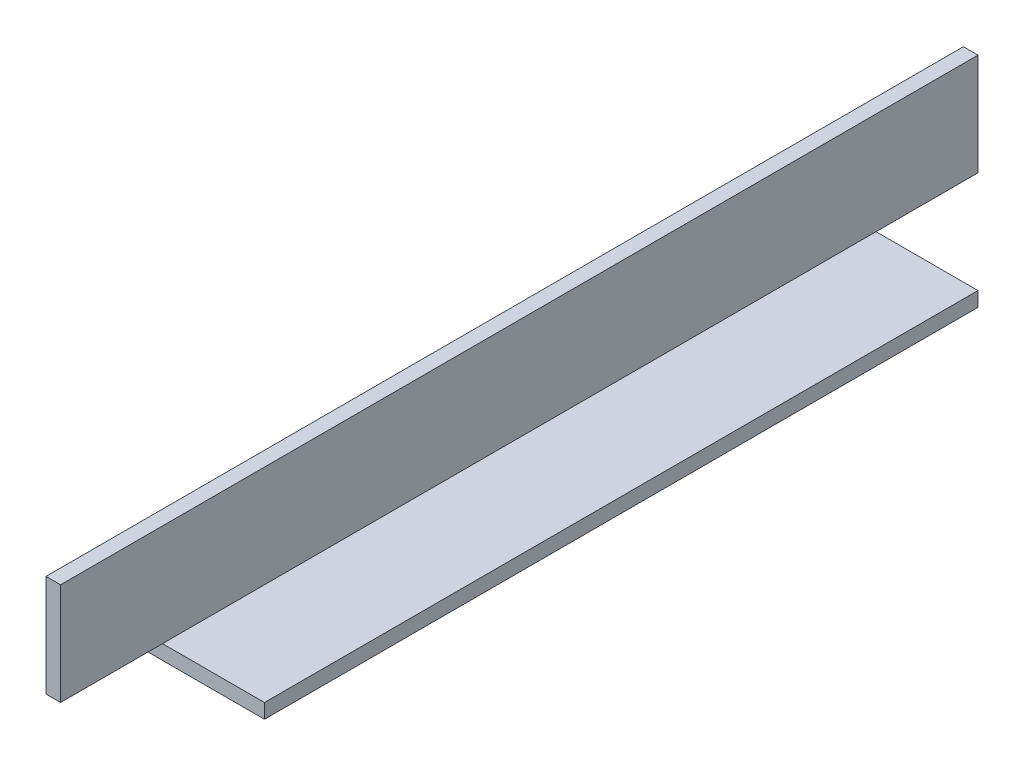
ISO-10303-21;
HEADER;
FILE_DESCRIPTION(('STEP AP214'),'2;1');
FILE_NAME('part.step','',(''),(''),'','','');
FILE_SCHEMA(('AUTOMOTIVE_DESIGN { 1 0 10303 214 1 1 1 1 }'));
ENDSEC;
DATA;
#1=APPLICATION_CONTEXT('core data for automotive mechanical design processes');
#2=APPLICATION_PROTOCOL_DEFINITION('international standard','automotive_design',2000,#1);
#3=PRODUCT_CONTEXT('',#1,'mechanical');
#4=PRODUCT('Part','Part','',(#3));
#5=PRODUCT_RELATED_PRODUCT_CATEGORY('part','',(#4));
#6=PRODUCT_DEFINITION_FORMATION('','',#4);
#7=PRODUCT_DEFINITION_CONTEXT('part definition',#1,'design');
#8=PRODUCT_DEFINITION('design','',#6,#7);
#9=PRODUCT_DEFINITION_SHAPE('','',#8);
#10=(LENGTH_UNIT() NAMED_UNIT(*) SI_UNIT(.MILLI.,.METRE.));
#11=(NAMED_UNIT(*) PLANE_ANGLE_UNIT() SI_UNIT($,.RADIAN.));
#12=(NAMED_UNIT(*) SI_UNIT($,.STERADIAN.) SOLID_ANGLE_UNIT());
#13=UNCERTAINTY_MEASURE_WITH_UNIT(LENGTH_MEASURE(1.E-05),#10,'distance_accuracy_value','');
#14=(GEOMETRIC_REPRESENTATION_CONTEXT(3) GLOBAL_UNCERTAINTY_ASSIGNED_CONTEXT((#13)) GLOBAL_UNIT_ASSIGNED_CONTEXT((#10,
#11,#12)) REPRESENTATION_CONTEXT('',''));
#15=CARTESIAN_POINT('',(0.,0.,0.));
#16=DIRECTION('',(0.,0.,1.));
#17=DIRECTION('',(1.,0.,0.));
#18=AXIS2_PLACEMENT_3D('',#15,#16,#17);
#19=CARTESIAN_POINT('',(0.,0.,1219.2));
#20=DIRECTION('',(0.,0.,1.));
#21=DIRECTION('',(1.,0.,0.));
#22=AXIS2_PLACEMENT_3D('',#19,#20,#21);
#23=PLANE('',#22);
#24=DIRECTION('',(1.,0.,0.));
#25=VECTOR('',#24,1.);
#26=CARTESIAN_POINT('',(25.4,3.175,1219.2));
#27=LINE('',#26,#25);
#28=CARTESIAN_POINT('',(0.,3.175,1219.2));
#29=VERTEX_POINT('',#28);
#30=CARTESIAN_POINT('',(3.175,3.175,1219.2));
#31=VERTEX_POINT('',#30);
#32=EDGE_CURVE('E163',#29,#31,#27,.T.);
#33=ORIENTED_EDGE('',*,*,#32,.T.);
#34=DIRECTION('',(0.,1.,0.));
#35=VECTOR('',#34,1.);
#36=CARTESIAN_POINT('',(3.175,3.175,1219.2));
#37=LINE('',#36,#35);
#38=CARTESIAN_POINT('',(3.175,25.4,1219.2));
#39=VERTEX_POINT('',#38);
#40=EDGE_CURVE('E55',#31,#39,#37,.T.);
#41=ORIENTED_EDGE('',*,*,#40,.T.);
#42=DIRECTION('',(-1.,0.,0.));
#43=VECTOR('',#42,1.);
#44=CARTESIAN_POINT('',(3.175,25.4,1219.2));
#45=LINE('',#44,#43);
#46=CARTESIAN_POINT('',(0.,25.4,1219.2));
#47=VERTEX_POINT('',#46);
#48=EDGE_CURVE('E145',#39,#47,#45,.T.);
#49=ORIENTED_EDGE('',*,*,#48,.T.);
#50=DIRECTION('',(0.,-1.,0.));
#51=VECTOR('',#50,1.);
#52=CARTESIAN_POINT('',(0.,25.4,1219.2));
#53=LINE('',#52,#51);
#54=EDGE_CURVE('E142',#47,#29,#53,.T.);
#55=ORIENTED_EDGE('',*,*,#54,.T.);
#56=EDGE_LOOP('',(#33,#41,#49,#55));
#57=FACE_BOUND('',#56,.T.);
#58=ADVANCED_FACE('F41',(#57),#23,.T.);
#59=CARTESIAN_POINT('',(60.,25.4,1019.2));
#60=DIRECTION('',(0.,0.,1.));
#61=DIRECTION('',(1.,0.,0.));
#62=AXIS2_PLACEMENT_3D('',#59,#60,#61);
#63=PLANE('',#62);
#64=DIRECTION('',(0.,1.,0.));
#65=VECTOR('',#64,1.);
#66=CARTESIAN_POINT('',(3.175,3.175,1019.2));
#67=LINE('',#66,#65);
#68=CARTESIAN_POINT('',(3.175,3.175,1019.2));
#69=VERTEX_POINT('',#68);
#70=CARTESIAN_POINT('',(3.17500000000002,25.4,1019.2));
#71=VERTEX_POINT('',#70);
#72=EDGE_CURVE('E113',#69,#71,#67,.T.);
#73=ORIENTED_EDGE('',*,*,#72,.F.);
#74=DIRECTION('',(1.,0.,0.));
#75=VECTOR('',#74,1.);
#76=CARTESIAN_POINT('',(60.,3.17500000000001,1019.2));
#77=LINE('',#76,#75);
#78=CARTESIAN_POINT('',(0.,3.175,1019.2));
#79=VERTEX_POINT('',#78);
#80=EDGE_CURVE('E49',#79,#69,#77,.T.);
#81=ORIENTED_EDGE('',*,*,#80,.F.);
#82=DIRECTION('',(0.,1.,0.));
#83=VECTOR('',#82,1.);
#84=CARTESIAN_POINT('',(0.,25.4,1019.2));
#85=LINE('',#84,#83);
#86=CARTESIAN_POINT('',(0.,25.4,1019.2));
#87=VERTEX_POINT('',#86);
#88=EDGE_CURVE('E149',#79,#87,#85,.T.);
#89=ORIENTED_EDGE('',*,*,#88,.T.);
#90=DIRECTION('',(-1.,0.,0.));
#91=VECTOR('',#90,1.);
#92=CARTESIAN_POINT('',(60.,25.4,1019.2));
#93=LINE('',#92,#91);
#94=EDGE_CURVE('E118',#71,#87,#93,.T.);
#95=ORIENTED_EDGE('',*,*,#94,.F.);
#96=EDGE_LOOP('',(#73,#81,#89,#95));
#97=FACE_BOUND('',#96,.T.);
#98=ADVANCED_FACE('F115',(#97),#63,.F.);
#99=CARTESIAN_POINT('',(3.175,3.175,1219.2));
#100=DIRECTION('',(-1.,0.,0.));
#101=DIRECTION('',(0.,-1.,0.));
#102=AXIS2_PLACEMENT_3D('',#99,#100,#101);
#103=PLANE('',#102);
#104=DIRECTION('',(0.,0.,-1.));
#105=VECTOR('',#104,1.);
#106=CARTESIAN_POINT('',(3.175,25.4,1219.2));
#107=LINE('',#106,#105);
#108=EDGE_CURVE('E129',#39,#71,#107,.T.);
#109=ORIENTED_EDGE('',*,*,#108,.F.);
#110=ORIENTED_EDGE('',*,*,#40,.F.);
#111=DIRECTION('',(0.,0.,-1.));
#112=VECTOR('',#111,1.);
#113=CARTESIAN_POINT('',(3.175,3.175,1219.2));
#114=LINE('',#113,#112);
#115=CARTESIAN_POINT('',(3.175,3.175,1196.97));
#116=VERTEX_POINT('',#115);
#117=EDGE_CURVE('E11',#31,#116,#114,.T.);
#118=ORIENTED_EDGE('',*,*,#117,.T.);
#119=DIRECTION('',(0.,0.,-1.));
#120=VECTOR('',#119,1.);
#121=CARTESIAN_POINT('',(3.175,3.175,1239.2));
#122=LINE('',#121,#120);
#123=CARTESIAN_POINT('',(3.175,3.175,1041.43));
#124=VERTEX_POINT('',#123);
#125=EDGE_CURVE('E125',#116,#124,#122,.T.);
#126=ORIENTED_EDGE('',*,*,#125,.T.);
#127=EDGE_CURVE('E123',#124,#69,#122,.T.);
#128=ORIENTED_EDGE('',*,*,#127,.T.);
#129=ORIENTED_EDGE('',*,*,#72,.T.);
#130=EDGE_LOOP('',(#109,#110,#118,#126,#128,#129));
#131=FACE_BOUND('',#130,.T.);
#132=ADVANCED_FACE('F43',(#131),#103,.F.);
#133=CARTESIAN_POINT('',(3.175,25.4,1219.2));
#134=DIRECTION('',(0.,-1.,0.));
#135=DIRECTION('',(1.,0.,0.));
#136=AXIS2_PLACEMENT_3D('',#133,#134,#135);
#137=PLANE('',#136);
#138=ORIENTED_EDGE('',*,*,#108,.T.);
#139=ORIENTED_EDGE('',*,*,#94,.T.);
#140=DIRECTION('',(0.,0.,-1.));
#141=VECTOR('',#140,1.);
#142=CARTESIAN_POINT('',(0.,25.4,1219.2));
#143=LINE('',#142,#141);
#144=EDGE_CURVE('E130',#47,#87,#143,.T.);
#145=ORIENTED_EDGE('',*,*,#144,.F.);
#146=ORIENTED_EDGE('',*,*,#48,.F.);
#147=EDGE_LOOP('',(#138,#139,#145,#146));
#148=FACE_BOUND('',#147,.T.);
#149=ADVANCED_FACE('F208',(#148),#137,.F.);
#150=CARTESIAN_POINT('',(0.,25.4,1219.2));
#151=DIRECTION('',(1.,0.,0.));
#152=DIRECTION('',(0.,1.,0.));
#153=AXIS2_PLACEMENT_3D('',#150,#151,#152);
#154=PLANE('',#153);
#155=DIRECTION('',(0.,0.,-1.));
#156=VECTOR('',#155,1.);
#157=CARTESIAN_POINT('',(0.,0.,1219.2));
#158=LINE('',#157,#156);
#159=CARTESIAN_POINT('',(0.,0.,1196.97));
#160=VERTEX_POINT('',#159);
#161=CARTESIAN_POINT('',(0.,0.,1041.43));
#162=VERTEX_POINT('',#161);
#163=EDGE_CURVE('E135',#160,#162,#158,.T.);
#164=ORIENTED_EDGE('',*,*,#163,.F.);
#165=DIRECTION('',(0.,-1.,0.));
#166=VECTOR('',#165,1.);
#167=CARTESIAN_POINT('',(0.,36.9290056882142,1196.97));
#168=LINE('',#167,#166);
#169=CARTESIAN_POINT('',(0.,3.175,1196.97));
#170=VERTEX_POINT('',#169);
#171=EDGE_CURVE('E168',#170,#160,#168,.T.);
#172=ORIENTED_EDGE('',*,*,#171,.F.);
#173=DIRECTION('',(0.,0.,1.));
#174=VECTOR('',#173,1.);
#175=CARTESIAN_POINT('',(0.,3.175,1219.2));
#176=LINE('',#175,#174);
#177=EDGE_CURVE('E174',#170,#29,#176,.T.);
#178=ORIENTED_EDGE('',*,*,#177,.T.);
#179=ORIENTED_EDGE('',*,*,#54,.F.);
#180=ORIENTED_EDGE('',*,*,#144,.T.);
#181=ORIENTED_EDGE('',*,*,#88,.F.);
#182=DIRECTION('',(0.,0.,1.));
#183=VECTOR('',#182,1.);
#184=CARTESIAN_POINT('',(0.,3.175,1019.2));
#185=LINE('',#184,#183);
#186=CARTESIAN_POINT('',(0.,3.175,1041.43));
#187=VERTEX_POINT('',#186);
#188=EDGE_CURVE('E63',#79,#187,#185,.T.);
#189=ORIENTED_EDGE('',*,*,#188,.T.);
#190=DIRECTION('',(0.,-1.,0.));
#191=VECTOR('',#190,1.);
#192=CARTESIAN_POINT('',(0.,36.9290056882142,1041.43));
#193=LINE('',#192,#191);
#194=EDGE_CURVE('E157',#187,#162,#193,.T.);
#195=ORIENTED_EDGE('',*,*,#194,.T.);
#196=EDGE_LOOP('',(#164,#172,#178,#179,#180,#181,#189,#195));
#197=FACE_BOUND('',#196,.T.);
#198=ADVANCED_FACE('F191',(#197),#154,.F.);
#199=CARTESIAN_POINT('',(0.,0.,1219.2));
#200=DIRECTION('',(0.,1.,0.));
#201=DIRECTION('',(0.,0.,1.));
#202=AXIS2_PLACEMENT_3D('',#199,#200,#201);
#203=PLANE('',#202);
#204=DIRECTION('',(0.,0.,-1.));
#205=VECTOR('',#204,1.);
#206=CARTESIAN_POINT('',(25.4,0.,1219.2));
#207=LINE('',#206,#205);
#208=CARTESIAN_POINT('',(25.4,0.,1196.97));
#209=VERTEX_POINT('',#208);
#210=CARTESIAN_POINT('',(25.4,0.,1041.43));
#211=VERTEX_POINT('',#210);
#212=EDGE_CURVE('E137',#209,#211,#207,.T.);
#213=ORIENTED_EDGE('',*,*,#212,.F.);
#214=DIRECTION('',(1.,0.,0.));
#215=VECTOR('',#214,1.);
#216=CARTESIAN_POINT('',(25.4,0.,1196.97));
#217=LINE('',#216,#215);
#218=EDGE_CURVE('E171',#160,#209,#217,.T.);
#219=ORIENTED_EDGE('',*,*,#218,.F.);
#220=ORIENTED_EDGE('',*,*,#163,.T.);
#221=DIRECTION('',(-1.,0.,0.));
#222=VECTOR('',#221,1.);
#223=CARTESIAN_POINT('',(25.4,0.,1041.43));
#224=LINE('',#223,#222);
#225=EDGE_CURVE('E158',#211,#162,#224,.T.);
#226=ORIENTED_EDGE('',*,*,#225,.F.);
#227=EDGE_LOOP('',(#213,#219,#220,#226));
#228=FACE_BOUND('',#227,.T.);
#229=ADVANCED_FACE('F195',(#228),#203,.F.);
#230=CARTESIAN_POINT('',(25.4,0.,1219.2));
#231=DIRECTION('',(-1.,0.,0.));
#232=DIRECTION('',(0.,0.,1.));
#233=AXIS2_PLACEMENT_3D('',#230,#231,#232);
#234=PLANE('',#233);
#235=DIRECTION('',(0.,0.,-1.));
#236=VECTOR('',#235,1.);
#237=CARTESIAN_POINT('',(25.4,3.175,1219.2));
#238=LINE('',#237,#236);
#239=CARTESIAN_POINT('',(25.4,3.175,1196.97));
#240=VERTEX_POINT('',#239);
#241=CARTESIAN_POINT('',(25.4,3.175,1041.43));
#242=VERTEX_POINT('',#241);
#243=EDGE_CURVE('E139',#240,#242,#238,.T.);
#244=ORIENTED_EDGE('',*,*,#243,.F.);
#245=DIRECTION('',(0.,-1.,0.));
#246=VECTOR('',#245,1.);
#247=CARTESIAN_POINT('',(25.4,36.9290056882142,1196.97));
#248=LINE('',#247,#246);
#249=EDGE_CURVE('E170',#240,#209,#248,.T.);
#250=ORIENTED_EDGE('',*,*,#249,.T.);
#251=ORIENTED_EDGE('',*,*,#212,.T.);
#252=DIRECTION('',(0.,-1.,0.));
#253=VECTOR('',#252,1.);
#254=CARTESIAN_POINT('',(25.4,36.9290056882142,1041.43));
#255=LINE('',#254,#253);
#256=EDGE_CURVE('E154',#242,#211,#255,.T.);
#257=ORIENTED_EDGE('',*,*,#256,.F.);
#258=EDGE_LOOP('',(#244,#250,#251,#257));
#259=FACE_BOUND('',#258,.T.);
#260=ADVANCED_FACE('F201',(#259),#234,.F.);
#261=CARTESIAN_POINT('',(25.4,3.175,1219.2));
#262=DIRECTION('',(0.,-1.,0.));
#263=DIRECTION('',(1.,0.,0.));
#264=AXIS2_PLACEMENT_3D('',#261,#262,#263);
#265=PLANE('',#264);
#266=ORIENTED_EDGE('',*,*,#243,.T.);
#267=DIRECTION('',(1.,0.,0.));
#268=VECTOR('',#267,1.);
#269=CARTESIAN_POINT('',(25.4,3.175,1041.43));
#270=LINE('',#269,#268);
#271=EDGE_CURVE('E153',#124,#242,#270,.T.);
#272=ORIENTED_EDGE('',*,*,#271,.F.);
#273=ORIENTED_EDGE('',*,*,#125,.F.);
#274=DIRECTION('',(-1.,0.,0.));
#275=VECTOR('',#274,1.);
#276=CARTESIAN_POINT('',(25.4,3.175,1196.97));
#277=LINE('',#276,#275);
#278=EDGE_CURVE('E167',#240,#116,#277,.T.);
#279=ORIENTED_EDGE('',*,*,#278,.F.);
#280=EDGE_LOOP('',(#266,#272,#273,#279));
#281=FACE_BOUND('',#280,.T.);
#282=ADVANCED_FACE('F203',(#281),#265,.F.);
#283=CARTESIAN_POINT('',(25.4,36.9290056882142,1041.43));
#284=DIRECTION('',(0.,0.,1.));
#285=DIRECTION('',(1.,0.,0.));
#286=AXIS2_PLACEMENT_3D('',#283,#284,#285);
#287=PLANE('',#286);
#288=EDGE_CURVE('E151',#187,#124,#270,.T.);
#289=ORIENTED_EDGE('',*,*,#288,.T.);
#290=ORIENTED_EDGE('',*,*,#271,.T.);
#291=ORIENTED_EDGE('',*,*,#256,.T.);
#292=ORIENTED_EDGE('',*,*,#225,.T.);
#293=ORIENTED_EDGE('',*,*,#194,.F.);
#294=EDGE_LOOP('',(#289,#290,#291,#292,#293));
#295=FACE_BOUND('',#294,.T.);
#296=ADVANCED_FACE('F197',(#295),#287,.F.);
#297=CARTESIAN_POINT('',(25.4,3.175,1219.2));
#298=DIRECTION('',(0.,-1.,0.));
#299=DIRECTION('',(1.,0.,0.));
#300=AXIS2_PLACEMENT_3D('',#297,#298,#299);
#301=PLANE('',#300);
#302=ORIENTED_EDGE('',*,*,#127,.F.);
#303=ORIENTED_EDGE('',*,*,#288,.F.);
#304=ORIENTED_EDGE('',*,*,#188,.F.);
#305=ORIENTED_EDGE('',*,*,#80,.T.);
#306=EDGE_LOOP('',(#302,#303,#304,#305));
#307=FACE_BOUND('',#306,.T.);
#308=ADVANCED_FACE('F128',(#307),#301,.T.);
#309=CARTESIAN_POINT('',(25.4,36.9290056882142,1196.97));
#310=DIRECTION('',(0.,0.,-1.));
#311=DIRECTION('',(-1.,0.,0.));
#312=AXIS2_PLACEMENT_3D('',#309,#310,#311);
#313=PLANE('',#312);
#314=ORIENTED_EDGE('',*,*,#278,.T.);
#315=EDGE_CURVE('E177',#116,#170,#277,.T.);
#316=ORIENTED_EDGE('',*,*,#315,.T.);
#317=ORIENTED_EDGE('',*,*,#171,.T.);
#318=ORIENTED_EDGE('',*,*,#218,.T.);
#319=ORIENTED_EDGE('',*,*,#249,.F.);
#320=EDGE_LOOP('',(#314,#316,#317,#318,#319));
#321=FACE_BOUND('',#320,.T.);
#322=ADVANCED_FACE('F185',(#321),#313,.F.);
#323=CARTESIAN_POINT('',(25.4,3.175,1219.2));
#324=DIRECTION('',(0.,-1.,0.));
#325=DIRECTION('',(1.,0.,0.));
#326=AXIS2_PLACEMENT_3D('',#323,#324,#325);
#327=PLANE('',#326);
#328=ORIENTED_EDGE('',*,*,#117,.F.);
#329=ORIENTED_EDGE('',*,*,#32,.F.);
#330=ORIENTED_EDGE('',*,*,#177,.F.);
#331=ORIENTED_EDGE('',*,*,#315,.F.);
#332=EDGE_LOOP('',(#328,#329,#330,#331));
#333=FACE_BOUND('',#332,.T.);
#334=ADVANCED_FACE('F189',(#333),#327,.T.);
#335=CLOSED_SHELL('',(#58,#98,#132,#149,#198,#229,#260,#282,#296,#308,#322,#334));
#336=MANIFOLD_SOLID_BREP('B2',#335);
#337=ADVANCED_BREP_SHAPE_REPRESENTATION('',(#18,#336),#14);
#338=SHAPE_DEFINITION_REPRESENTATION(#9,#337);
ENDSEC;
END-ISO-10303-21;
